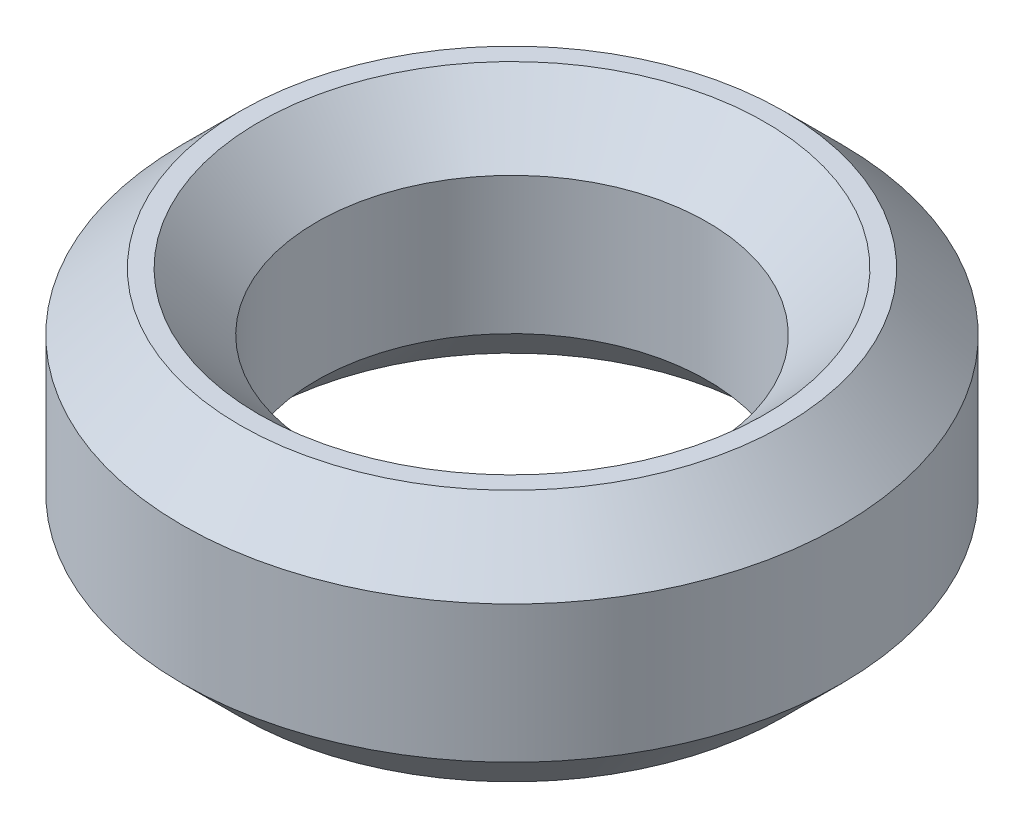
ISO-10303-21;
HEADER;
FILE_DESCRIPTION(('STEP AP214'),'2;1');
FILE_NAME('part.step','',(''),(''),'','','');
FILE_SCHEMA(('AUTOMOTIVE_DESIGN { 1 0 10303 214 1 1 1 1 }'));
ENDSEC;
DATA;
#1=APPLICATION_CONTEXT('core data for automotive mechanical design processes');
#2=APPLICATION_PROTOCOL_DEFINITION('international standard','automotive_design',2000,#1);
#3=PRODUCT_CONTEXT('',#1,'mechanical');
#4=PRODUCT('Part','Part','',(#3));
#5=PRODUCT_RELATED_PRODUCT_CATEGORY('part','',(#4));
#6=PRODUCT_DEFINITION_FORMATION('','',#4);
#7=PRODUCT_DEFINITION_CONTEXT('part definition',#1,'design');
#8=PRODUCT_DEFINITION('design','',#6,#7);
#9=PRODUCT_DEFINITION_SHAPE('','',#8);
#10=(LENGTH_UNIT() NAMED_UNIT(*) SI_UNIT(.MILLI.,.METRE.));
#11=(NAMED_UNIT(*) PLANE_ANGLE_UNIT() SI_UNIT($,.RADIAN.));
#12=(NAMED_UNIT(*) SI_UNIT($,.STERADIAN.) SOLID_ANGLE_UNIT());
#13=UNCERTAINTY_MEASURE_WITH_UNIT(LENGTH_MEASURE(1.E-05),#10,'distance_accuracy_value','');
#14=(GEOMETRIC_REPRESENTATION_CONTEXT(3) GLOBAL_UNCERTAINTY_ASSIGNED_CONTEXT((#13)) GLOBAL_UNIT_ASSIGNED_CONTEXT((#10,
#11,#12)) REPRESENTATION_CONTEXT('',''));
#15=CARTESIAN_POINT('',(0.,0.,0.));
#16=DIRECTION('',(0.,0.,1.));
#17=DIRECTION('',(1.,0.,0.));
#18=AXIS2_PLACEMENT_3D('',#15,#16,#17);
#19=CARTESIAN_POINT('',(0.,13.4016315498118,0.));
#20=DIRECTION('',(0.,-1.,0.));
#21=DIRECTION('',(0.,0.,-1.));
#22=AXIS2_PLACEMENT_3D('',#19,#20,#21);
#23=CYLINDRICAL_SURFACE('',#22,17.5);
#24=CARTESIAN_POINT('',(0.,3.06311245521599,0.));
#25=DIRECTION('',(0.,1.,0.));
#26=DIRECTION('',(0.,0.,1.));
#27=AXIS2_PLACEMENT_3D('',#24,#25,#26);
#28=CIRCLE('',#27,17.5);
#29=CARTESIAN_POINT('',(0.,3.06311245521599,17.5));
#30=VERTEX_POINT('',#29);
#31=EDGE_CURVE('E10',#30,#30,#28,.T.);
#32=ORIENTED_EDGE('',*,*,#31,.T.);
#33=EDGE_LOOP('',(#32));
#34=FACE_BOUND('',#33,.T.);
#35=CARTESIAN_POINT('',(0.,10.3385190945958,0.));
#36=DIRECTION('',(0.,1.,0.));
#37=DIRECTION('',(0.,0.,1.));
#38=AXIS2_PLACEMENT_3D('',#35,#36,#37);
#39=CIRCLE('',#38,17.5);
#40=CARTESIAN_POINT('',(0.,10.3385190945958,-17.5));
#41=VERTEX_POINT('',#40);
#42=EDGE_CURVE('E50',#41,#41,#39,.F.);
#43=ORIENTED_EDGE('',*,*,#42,.T.);
#44=EDGE_LOOP('',(#43));
#45=FACE_BOUND('',#44,.T.);
#46=ADVANCED_FACE('F39',(#34,#45),#23,.T.);
#47=CARTESIAN_POINT('',(0.,13.4016315498118,0.));
#48=DIRECTION('',(0.,1.,0.));
#49=DIRECTION('',(0.,0.,1.));
#50=AXIS2_PLACEMENT_3D('',#47,#48,#49);
#51=PLANE('',#50);
#52=CARTESIAN_POINT('',(0.,13.4016315498118,0.));
#53=DIRECTION('',(0.,1.,0.));
#54=DIRECTION('',(0.,0.,1.));
#55=AXIS2_PLACEMENT_3D('',#52,#53,#54);
#56=CIRCLE('',#55,13.4342688666244);
#57=CARTESIAN_POINT('',(0.,13.4016315498118,13.4342688666244));
#58=VERTEX_POINT('',#57);
#59=EDGE_CURVE('E58',#58,#58,#56,.F.);
#60=ORIENTED_EDGE('',*,*,#59,.T.);
#61=EDGE_LOOP('',(#60));
#62=FACE_BOUND('',#61,.T.);
#63=CARTESIAN_POINT('',(0.,13.4016315498118,0.));
#64=DIRECTION('',(0.,1.,0.));
#65=DIRECTION('',(0.,0.,1.));
#66=AXIS2_PLACEMENT_3D('',#63,#64,#65);
#67=CIRCLE('',#66,14.436887544784);
#68=CARTESIAN_POINT('',(0.,13.4016315498118,-14.436887544784));
#69=VERTEX_POINT('',#68);
#70=EDGE_CURVE('E61',#69,#69,#67,.T.);
#71=ORIENTED_EDGE('',*,*,#70,.T.);
#72=EDGE_LOOP('',(#71));
#73=FACE_BOUND('',#72,.T.);
#74=ADVANCED_FACE('F88',(#62,#73),#51,.T.);
#75=CARTESIAN_POINT('',(0.,0.,0.));
#76=DIRECTION('',(0.,1.,0.));
#77=DIRECTION('',(0.,0.,1.));
#78=AXIS2_PLACEMENT_3D('',#75,#76,#77);
#79=PLANE('',#78);
#80=CARTESIAN_POINT('',(0.,0.,0.));
#81=DIRECTION('',(0.,1.,0.));
#82=DIRECTION('',(0.,0.,1.));
#83=AXIS2_PLACEMENT_3D('',#80,#81,#82);
#84=CIRCLE('',#83,13.4342688666244);
#85=CARTESIAN_POINT('',(0.,0.,13.4342688666244));
#86=VERTEX_POINT('',#85);
#87=EDGE_CURVE('E51',#86,#86,#84,.T.);
#88=ORIENTED_EDGE('',*,*,#87,.T.);
#89=EDGE_LOOP('',(#88));
#90=FACE_BOUND('',#89,.T.);
#91=CARTESIAN_POINT('',(0.,0.,0.));
#92=DIRECTION('',(0.,1.,0.));
#93=DIRECTION('',(0.,0.,1.));
#94=AXIS2_PLACEMENT_3D('',#91,#92,#93);
#95=CIRCLE('',#94,14.436887544784);
#96=CARTESIAN_POINT('',(0.,0.,14.436887544784));
#97=VERTEX_POINT('',#96);
#98=EDGE_CURVE('E54',#97,#97,#95,.F.);
#99=ORIENTED_EDGE('',*,*,#98,.T.);
#100=EDGE_LOOP('',(#99));
#101=FACE_BOUND('',#100,.T.);
#102=ADVANCED_FACE('F83',(#90,#101),#79,.F.);
#103=CARTESIAN_POINT('',(0.,13.4016315498118,0.));
#104=DIRECTION('',(0.,-1.,0.));
#105=DIRECTION('',(0.,0.,-1.));
#106=AXIS2_PLACEMENT_3D('',#103,#104,#105);
#107=CYLINDRICAL_SURFACE('',#106,10.3711564114084);
#108=CARTESIAN_POINT('',(0.,10.3385190945958,0.));
#109=DIRECTION('',(0.,1.,0.));
#110=DIRECTION('',(0.,0.,1.));
#111=AXIS2_PLACEMENT_3D('',#108,#109,#110);
#112=CIRCLE('',#111,10.3711564114084);
#113=CARTESIAN_POINT('',(0.,10.3385190945958,10.3711564114084));
#114=VERTEX_POINT('',#113);
#115=EDGE_CURVE('E67',#114,#114,#112,.T.);
#116=ORIENTED_EDGE('',*,*,#115,.T.);
#117=EDGE_LOOP('',(#116));
#118=FACE_BOUND('',#117,.T.);
#119=CARTESIAN_POINT('',(0.,3.06311245521601,0.));
#120=DIRECTION('',(0.,1.,0.));
#121=DIRECTION('',(0.,0.,1.));
#122=AXIS2_PLACEMENT_3D('',#119,#120,#121);
#123=CIRCLE('',#122,10.3711564114084);
#124=CARTESIAN_POINT('',(0.,3.06311245521601,10.3711564114084));
#125=VERTEX_POINT('',#124);
#126=EDGE_CURVE('E69',#125,#125,#123,.F.);
#127=ORIENTED_EDGE('',*,*,#126,.T.);
#128=EDGE_LOOP('',(#127));
#129=FACE_BOUND('',#128,.T.);
#130=ADVANCED_FACE('F71',(#118,#129),#107,.F.);
#131=CARTESIAN_POINT('',(0.,10.3385190945958,0.));
#132=DIRECTION('',(0.,1.,0.));
#133=DIRECTION('',(0.,0.,1.));
#134=AXIS2_PLACEMENT_3D('',#131,#132,#133);
#135=CONICAL_SURFACE('',#134,10.3711564114084,0.785398163397452);
#136=CARTESIAN_POINT('',(0.,13.4016315498118,13.4342688666244));
#137=CARTESIAN_POINT('',(0.,13.3697241284033,13.4023614452159));
#138=CARTESIAN_POINT('',(0.,13.3378167069948,13.3704540238074));
#139=CARTESIAN_POINT('',(0.,13.2740018641778,13.3066391809904));
#140=CARTESIAN_POINT('',(0.,13.2420944427693,13.2747317595819));
#141=CARTESIAN_POINT('',(0.,13.1782795999523,13.2109169167649));
#142=CARTESIAN_POINT('',(0.,13.1463721785438,13.1790094953564));
#143=CARTESIAN_POINT('',(0.,13.0825573357268,13.1151946525394));
#144=CARTESIAN_POINT('',(0.,13.0506499143183,13.0832872311309));
#145=CARTESIAN_POINT('',(0.,12.9868350715013,13.0194723883139));
#146=CARTESIAN_POINT('',(0.,12.9549276500928,12.9875649669054));
#147=CARTESIAN_POINT('',(0.,12.8911128072758,12.9237501240884));
#148=CARTESIAN_POINT('',(0.,12.8592053858673,12.8918427026799));
#149=CARTESIAN_POINT('',(0.,12.7953905430503,12.8280278598629));
#150=CARTESIAN_POINT('',(0.,12.7634831216418,12.7961204384544));
#151=CARTESIAN_POINT('',(0.,12.6996682788248,12.7323055956374));
#152=CARTESIAN_POINT('',(0.,12.6677608574163,12.7003981742289));
#153=CARTESIAN_POINT('',(0.,12.6039460145993,12.6365833314119));
#154=CARTESIAN_POINT('',(0.,12.5720385931908,12.6046759100034));
#155=CARTESIAN_POINT('',(0.,12.5082237503738,12.5408610671864));
#156=CARTESIAN_POINT('',(0.,12.4763163289653,12.5089536457779));
#157=CARTESIAN_POINT('',(0.,12.4125014861483,12.4451388029609));
#158=CARTESIAN_POINT('',(0.,12.3805940647398,12.4132313815524));
#159=CARTESIAN_POINT('',(0.,12.3167792219228,12.3494165387354));
#160=CARTESIAN_POINT('',(0.,12.2848718005143,12.3175091173269));
#161=CARTESIAN_POINT('',(0.,12.2210569576973,12.2536942745099));
#162=CARTESIAN_POINT('',(0.,12.1891495362888,12.2217868531014));
#163=CARTESIAN_POINT('',(0.,12.1253346934718,12.1579720102844));
#164=CARTESIAN_POINT('',(0.,12.0934272720633,12.1260645888759));
#165=CARTESIAN_POINT('',(0.,12.0296124292463,12.0622497460589));
#166=CARTESIAN_POINT('',(0.,11.9977050078378,12.0303423246504));
#167=CARTESIAN_POINT('',(0.,11.9338901650208,11.9665274818334));
#168=CARTESIAN_POINT('',(0.,11.9019827436123,11.9346200604249));
#169=CARTESIAN_POINT('',(0.,11.8381679007953,11.8708052176079));
#170=CARTESIAN_POINT('',(0.,11.8062604793868,11.8388977961994));
#171=CARTESIAN_POINT('',(0.,11.7424456365698,11.7750829533824));
#172=CARTESIAN_POINT('',(0.,11.7105382151613,11.7431755319739));
#173=CARTESIAN_POINT('',(0.,11.6467233723443,11.6793606891569));
#174=CARTESIAN_POINT('',(0.,11.6148159509358,11.6474532677484));
#175=CARTESIAN_POINT('',(0.,11.5510011081188,11.5836384249314));
#176=CARTESIAN_POINT('',(0.,11.5190936867103,11.5517310035229));
#177=CARTESIAN_POINT('',(0.,11.4552788438933,11.4879161607059));
#178=CARTESIAN_POINT('',(0.,11.4233714224848,11.4560087392974));
#179=CARTESIAN_POINT('',(0.,11.3595565796678,11.3921938964804));
#180=CARTESIAN_POINT('',(0.,11.3276491582593,11.3602864750719));
#181=CARTESIAN_POINT('',(0.,11.2638343154423,11.2964716322549));
#182=CARTESIAN_POINT('',(0.,11.2319268940338,11.2645642108464));
#183=CARTESIAN_POINT('',(0.,11.1681120512168,11.2007493680294));
#184=CARTESIAN_POINT('',(0.,11.1362046298083,11.1688419466209));
#185=CARTESIAN_POINT('',(0.,11.0723897869913,11.1050271038039));
#186=CARTESIAN_POINT('',(0.,11.0404823655828,11.0731196823954));
#187=CARTESIAN_POINT('',(0.,10.9766675227658,11.0093048395784));
#188=CARTESIAN_POINT('',(0.,10.9447601013573,10.9773974181699));
#189=CARTESIAN_POINT('',(0.,10.8809452585403,10.9135825753529));
#190=CARTESIAN_POINT('',(0.,10.8490378371318,10.8816751539444));
#191=CARTESIAN_POINT('',(0.,10.7852229943148,10.8178603111274));
#192=CARTESIAN_POINT('',(0.,10.7533155729063,10.7859528897189));
#193=CARTESIAN_POINT('',(0.,10.6895007300893,10.7221380469019));
#194=CARTESIAN_POINT('',(0.,10.6575933086808,10.6902306254934));
#195=CARTESIAN_POINT('',(0.,10.5937784658638,10.6264157826764));
#196=CARTESIAN_POINT('',(0.,10.5618710444553,10.5945083612679));
#197=CARTESIAN_POINT('',(0.,10.4980562016383,10.5306935184509));
#198=CARTESIAN_POINT('',(0.,10.4661487802298,10.4987860970424));
#199=CARTESIAN_POINT('',(0.,10.4023339374128,10.4349712542254));
#200=CARTESIAN_POINT('',(0.,10.3704265160043,10.4030638328169));
#201=CARTESIAN_POINT('',(0.,10.3385190945958,10.3711564114084));
#202=B_SPLINE_CURVE_WITH_KNOTS('',3,(#136,#137,#138,#139,#140,#141,#142,#143,#144,#145,#146,
#147,#148,#149,#150,#151,#152,#153,#154,#155,#156,#157,#158,#159,#160,#161,#162,#163,#164,#165,
#166,#167,#168,#169,#170,#171,#172,#173,#174,#175,#176,#177,#178,#179,#180,#181,#182,#183,#184,
#185,#186,#187,#188,#189,#190,#191,#192,#193,#194,#195,#196,#197,#198,#199,#200,#201),
.UNSPECIFIED.,.F.,.F.,(4,2,2,2,2,2,2,2,2,2,2,2,2,2,2,2,2,2,2,2,2,2,2,2,2,2,2,2,2,2,2,2,4),(0.,
0.135371724288764,0.270743448577526,0.406115172866289,0.541486897155051,0.676858621443815,
0.812230345732577,0.947602070021341,1.0829737943101,1.21834551859887,1.35371724288763,
1.48908896717639,1.62446069146515,1.75983241575392,1.89520414004268,2.03057586433144,
2.16594758862021,2.30131931290897,2.43669103719773,2.5720627614865,2.70743448577526,
2.84280621006402,2.97817793435278,3.11354965864155,3.24892138293031,3.38429310721907,
3.51966483150784,3.6550365557966,3.79040828008536,3.92578000437412,4.06115172866289,
4.19652345295165,4.33189517724041),.UNSPECIFIED.);
#203=EDGE_CURVE('BSEAM77',#58,#114,#202,.T.);
#204=ORIENTED_EDGE('',*,*,#59,.F.);
#205=ORIENTED_EDGE('',*,*,#115,.F.);
#206=ORIENTED_EDGE('',*,*,#203,.T.);
#207=ORIENTED_EDGE('',*,*,#203,.F.);
#208=EDGE_LOOP('',(#204,#206,#205,#207));
#209=FACE_BOUND('',#208,.T.);
#210=ADVANCED_FACE('F77',(#209),#135,.F.);
#211=CARTESIAN_POINT('',(0.,0.,0.));
#212=DIRECTION('',(0.,-1.,0.));
#213=DIRECTION('',(0.,0.,-1.));
#214=AXIS2_PLACEMENT_3D('',#211,#212,#213);
#215=CONICAL_SURFACE('',#214,13.4342688666244,0.785398163397445);
#216=ORIENTED_EDGE('',*,*,#126,.F.);
#217=EDGE_LOOP('',(#216));
#218=FACE_BOUND('',#217,.T.);
#219=ORIENTED_EDGE('',*,*,#87,.F.);
#220=EDGE_LOOP('',(#219));
#221=FACE_BOUND('',#220,.T.);
#222=ADVANCED_FACE('F73',(#218,#221),#215,.F.);
#223=CARTESIAN_POINT('',(0.,3.06311245521599,0.));
#224=DIRECTION('',(0.,1.,0.));
#225=DIRECTION('',(0.,0.,1.));
#226=AXIS2_PLACEMENT_3D('',#223,#224,#225);
#227=CONICAL_SURFACE('',#226,17.5,0.785398163397452);
#228=ORIENTED_EDGE('',*,*,#98,.F.);
#229=EDGE_LOOP('',(#228));
#230=FACE_BOUND('',#229,.T.);
#231=ORIENTED_EDGE('',*,*,#31,.F.);
#232=EDGE_LOOP('',(#231));
#233=FACE_BOUND('',#232,.T.);
#234=ADVANCED_FACE('F76',(#230,#233),#227,.T.);
#235=CARTESIAN_POINT('',(0.,13.4016315498118,0.));
#236=DIRECTION('',(0.,-1.,0.));
#237=DIRECTION('',(0.,0.,-1.));
#238=AXIS2_PLACEMENT_3D('',#235,#236,#237);
#239=CONICAL_SURFACE('',#238,14.436887544784,0.785398163397444);
#240=CARTESIAN_POINT('',(0.,10.3385190945958,-17.5));
#241=CARTESIAN_POINT('',(0.,10.3704265160043,-17.4680925785915));
#242=CARTESIAN_POINT('',(0.,10.4023339374128,-17.436185157183));
#243=CARTESIAN_POINT('',(0.,10.4661487802298,-17.372370314366));
#244=CARTESIAN_POINT('',(0.,10.4980562016383,-17.3404628929575));
#245=CARTESIAN_POINT('',(0.,10.5618710444553,-17.2766480501405));
#246=CARTESIAN_POINT('',(0.,10.5937784658638,-17.244740628732));
#247=CARTESIAN_POINT('',(0.,10.6575933086808,-17.180925785915));
#248=CARTESIAN_POINT('',(0.,10.6895007300893,-17.1490183645065));
#249=CARTESIAN_POINT('',(0.,10.7533155729063,-17.0852035216895));
#250=CARTESIAN_POINT('',(0.,10.7852229943148,-17.053296100281));
#251=CARTESIAN_POINT('',(0.,10.8490378371318,-16.989481257464));
#252=CARTESIAN_POINT('',(0.,10.8809452585403,-16.9575738360555));
#253=CARTESIAN_POINT('',(0.,10.9447601013573,-16.8937589932385));
#254=CARTESIAN_POINT('',(0.,10.9766675227658,-16.86185157183));
#255=CARTESIAN_POINT('',(0.,11.0404823655828,-16.798036729013));
#256=CARTESIAN_POINT('',(0.,11.0723897869913,-16.7661293076045));
#257=CARTESIAN_POINT('',(0.,11.1362046298083,-16.7023144647875));
#258=CARTESIAN_POINT('',(0.,11.1681120512168,-16.670407043379));
#259=CARTESIAN_POINT('',(0.,11.2319268940338,-16.606592200562));
#260=CARTESIAN_POINT('',(0.,11.2638343154423,-16.5746847791535));
#261=CARTESIAN_POINT('',(0.,11.3276491582593,-16.5108699363365));
#262=CARTESIAN_POINT('',(0.,11.3595565796678,-16.478962514928));
#263=CARTESIAN_POINT('',(0.,11.4233714224848,-16.415147672111));
#264=CARTESIAN_POINT('',(0.,11.4552788438933,-16.3832402507025));
#265=CARTESIAN_POINT('',(0.,11.5190936867103,-16.3194254078855));
#266=CARTESIAN_POINT('',(0.,11.5510011081188,-16.287517986477));
#267=CARTESIAN_POINT('',(0.,11.6148159509358,-16.22370314366));
#268=CARTESIAN_POINT('',(0.,11.6467233723443,-16.1917957222515));
#269=CARTESIAN_POINT('',(0.,11.7105382151613,-16.1279808794345));
#270=CARTESIAN_POINT('',(0.,11.7424456365698,-16.096073458026));
#271=CARTESIAN_POINT('',(0.,11.8062604793868,-16.032258615209));
#272=CARTESIAN_POINT('',(0.,11.8381679007953,-16.0003511938005));
#273=CARTESIAN_POINT('',(0.,11.9019827436123,-15.9365363509835));
#274=CARTESIAN_POINT('',(0.,11.9338901650208,-15.904628929575));
#275=CARTESIAN_POINT('',(0.,11.9977050078378,-15.840814086758));
#276=CARTESIAN_POINT('',(0.,12.0296124292463,-15.8089066653495));
#277=CARTESIAN_POINT('',(0.,12.0934272720633,-15.7450918225325));
#278=CARTESIAN_POINT('',(0.,12.1253346934718,-15.713184401124));
#279=CARTESIAN_POINT('',(0.,12.1891495362888,-15.649369558307));
#280=CARTESIAN_POINT('',(0.,12.2210569576973,-15.6174621368985));
#281=CARTESIAN_POINT('',(0.,12.2848718005143,-15.5536472940815));
#282=CARTESIAN_POINT('',(0.,12.3167792219228,-15.521739872673));
#283=CARTESIAN_POINT('',(0.,12.3805940647398,-15.457925029856));
#284=CARTESIAN_POINT('',(0.,12.4125014861483,-15.4260176084475));
#285=CARTESIAN_POINT('',(0.,12.4763163289653,-15.3622027656305));
#286=CARTESIAN_POINT('',(0.,12.5082237503738,-15.330295344222));
#287=CARTESIAN_POINT('',(0.,12.5720385931908,-15.266480501405));
#288=CARTESIAN_POINT('',(0.,12.6039460145993,-15.2345730799965));
#289=CARTESIAN_POINT('',(0.,12.6677608574163,-15.1707582371795));
#290=CARTESIAN_POINT('',(0.,12.6996682788248,-15.138850815771));
#291=CARTESIAN_POINT('',(0.,12.7634831216418,-15.075035972954));
#292=CARTESIAN_POINT('',(0.,12.7953905430503,-15.0431285515455));
#293=CARTESIAN_POINT('',(0.,12.8592053858673,-14.9793137087285));
#294=CARTESIAN_POINT('',(0.,12.8911128072758,-14.94740628732));
#295=CARTESIAN_POINT('',(0.,12.9549276500928,-14.883591444503));
#296=CARTESIAN_POINT('',(0.,12.9868350715013,-14.8516840230945));
#297=CARTESIAN_POINT('',(0.,13.0506499143183,-14.7878691802775));
#298=CARTESIAN_POINT('',(0.,13.0825573357268,-14.755961758869));
#299=CARTESIAN_POINT('',(0.,13.1463721785438,-14.692146916052));
#300=CARTESIAN_POINT('',(0.,13.1782795999523,-14.6602394946435));
#301=CARTESIAN_POINT('',(0.,13.2420944427693,-14.5964246518265));
#302=CARTESIAN_POINT('',(0.,13.2740018641778,-14.564517230418));
#303=CARTESIAN_POINT('',(0.,13.3378167069948,-14.500702387601));
#304=CARTESIAN_POINT('',(0.,13.3697241284033,-14.4687949661925));
#305=CARTESIAN_POINT('',(0.,13.4016315498118,-14.436887544784));
#306=B_SPLINE_CURVE_WITH_KNOTS('',3,(#240,#241,#242,#243,#244,#245,#246,#247,#248,#249,#250,
#251,#252,#253,#254,#255,#256,#257,#258,#259,#260,#261,#262,#263,#264,#265,#266,#267,#268,#269,
#270,#271,#272,#273,#274,#275,#276,#277,#278,#279,#280,#281,#282,#283,#284,#285,#286,#287,#288,
#289,#290,#291,#292,#293,#294,#295,#296,#297,#298,#299,#300,#301,#302,#303,#304,#305),
.UNSPECIFIED.,.F.,.F.,(4,2,2,2,2,2,2,2,2,2,2,2,2,2,2,2,2,2,2,2,2,2,2,2,2,2,2,2,2,2,2,2,4),(0.,
0.135371724288762,0.270743448577523,0.406115172866286,0.54148689715505,0.676858621443812,
0.812230345732575,0.947602070021337,1.0829737943101,1.21834551859886,1.35371724288763,
1.48908896717639,1.62446069146515,1.75983241575391,1.89520414004268,2.03057586433144,
2.1659475886202,2.30131931290896,2.43669103719773,2.57206276148649,2.70743448577525,
2.84280621006401,2.97817793435278,3.11354965864154,3.2489213829303,3.38429310721907,
3.51966483150783,3.65503655579659,3.79040828008535,3.92578000437411,4.06115172866288,
4.19652345295164,4.3318951772404),.UNSPECIFIED.);
#307=EDGE_CURVE('BSEAM45',#41,#69,#306,.T.);
#308=ORIENTED_EDGE('',*,*,#42,.F.);
#309=ORIENTED_EDGE('',*,*,#70,.F.);
#310=ORIENTED_EDGE('',*,*,#307,.T.);
#311=ORIENTED_EDGE('',*,*,#307,.F.);
#312=EDGE_LOOP('',(#308,#310,#309,#311));
#313=FACE_BOUND('',#312,.T.);
#314=ADVANCED_FACE('F45',(#313),#239,.T.);
#315=CLOSED_SHELL('',(#46,#74,#102,#130,#210,#222,#234,#314));
#316=MANIFOLD_SOLID_BREP('B2',#315);
#317=ADVANCED_BREP_SHAPE_REPRESENTATION('',(#18,#316),#14);
#318=SHAPE_DEFINITION_REPRESENTATION(#9,#317);
ENDSEC;
END-ISO-10303-21;
